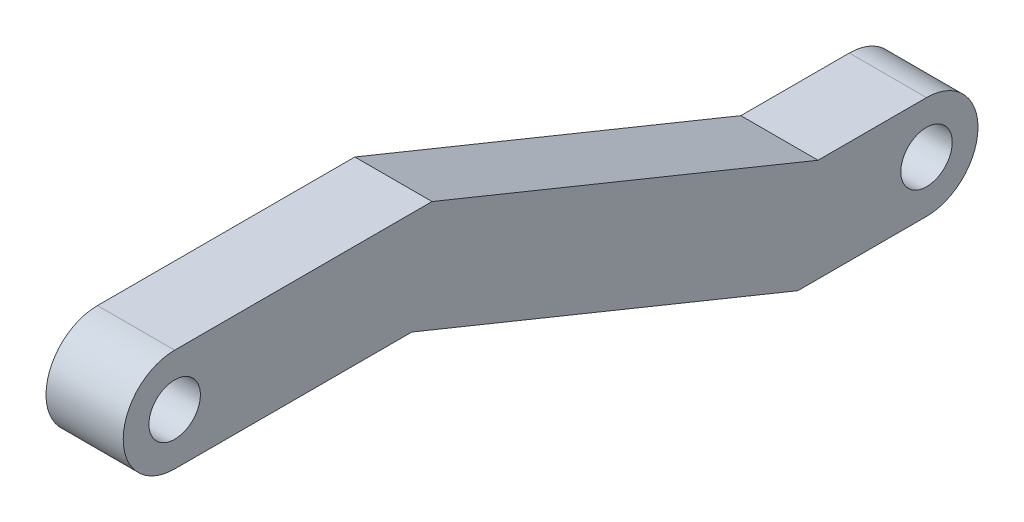
ISO-10303-21;
HEADER;
FILE_DESCRIPTION(('STEP AP214'),'2;1');
FILE_NAME('part.step','',(''),(''),'','','');
FILE_SCHEMA(('AUTOMOTIVE_DESIGN { 1 0 10303 214 1 1 1 1 }'));
ENDSEC;
DATA;
#1=APPLICATION_CONTEXT('core data for automotive mechanical design processes');
#2=APPLICATION_PROTOCOL_DEFINITION('international standard','automotive_design',2000,#1);
#3=PRODUCT_CONTEXT('',#1,'mechanical');
#4=PRODUCT('Part','Part','',(#3));
#5=PRODUCT_RELATED_PRODUCT_CATEGORY('part','',(#4));
#6=PRODUCT_DEFINITION_FORMATION('','',#4);
#7=PRODUCT_DEFINITION_CONTEXT('part definition',#1,'design');
#8=PRODUCT_DEFINITION('design','',#6,#7);
#9=PRODUCT_DEFINITION_SHAPE('','',#8);
#10=(LENGTH_UNIT() NAMED_UNIT(*) SI_UNIT(.MILLI.,.METRE.));
#11=(NAMED_UNIT(*) PLANE_ANGLE_UNIT() SI_UNIT($,.RADIAN.));
#12=(NAMED_UNIT(*) SI_UNIT($,.STERADIAN.) SOLID_ANGLE_UNIT());
#13=UNCERTAINTY_MEASURE_WITH_UNIT(LENGTH_MEASURE(1.E-05),#10,'distance_accuracy_value','');
#14=(GEOMETRIC_REPRESENTATION_CONTEXT(3) GLOBAL_UNCERTAINTY_ASSIGNED_CONTEXT((#13)) GLOBAL_UNIT_ASSIGNED_CONTEXT((#10,
#11,#12)) REPRESENTATION_CONTEXT('',''));
#15=CARTESIAN_POINT('',(0.,0.,0.));
#16=DIRECTION('',(0.,0.,1.));
#17=DIRECTION('',(1.,0.,0.));
#18=AXIS2_PLACEMENT_3D('',#15,#16,#17);
#19=CARTESIAN_POINT('',(3.,-2.,10.0014603676843));
#20=DIRECTION('',(1.,0.,0.));
#21=DIRECTION('',(0.,0.,-1.));
#22=AXIS2_PLACEMENT_3D('',#19,#20,#21);
#23=PLANE('',#22);
#24=CARTESIAN_POINT('',(3.,-2.,10.0014603676843));
#25=DIRECTION('',(1.,0.,0.));
#26=DIRECTION('',(0.,0.,-1.));
#27=AXIS2_PLACEMENT_3D('',#24,#25,#26);
#28=CIRCLE('',#27,1.);
#29=CARTESIAN_POINT('',(3.,-2.,9.00146036768433));
#30=VERTEX_POINT('',#29);
#31=EDGE_CURVE('E152',#30,#30,#28,.T.);
#32=ORIENTED_EDGE('',*,*,#31,.F.);
#33=EDGE_LOOP('',(#32));
#34=FACE_BOUND('',#33,.T.);
#35=DIRECTION('',(0.,0.377201339937969,0.926131280731302));
#36=VECTOR('',#35,1.);
#37=CARTESIAN_POINT('',(3.,-6.10930676545315,-15.));
#38=LINE('',#37,#36);
#39=CARTESIAN_POINT('',(3.,-6.10930676545315,-15.));
#40=VERTEX_POINT('',#39);
#41=CARTESIAN_POINT('',(3.,0.,0.));
#42=VERTEX_POINT('',#41);
#43=EDGE_CURVE('E170',#40,#42,#38,.T.);
#44=ORIENTED_EDGE('',*,*,#43,.T.);
#45=DIRECTION('',(0.,0.,1.));
#46=VECTOR('',#45,1.);
#47=CARTESIAN_POINT('',(3.,0.,0.));
#48=LINE('',#47,#46);
#49=CARTESIAN_POINT('',(3.,0.,10.0014603676843));
#50=VERTEX_POINT('',#49);
#51=EDGE_CURVE('E106',#42,#50,#48,.T.);
#52=ORIENTED_EDGE('',*,*,#51,.T.);
#53=CARTESIAN_POINT('',(3.,-2.,10.0014603676843));
#54=DIRECTION('',(1.,0.,0.));
#55=DIRECTION('',(0.,0.,-1.));
#56=AXIS2_PLACEMENT_3D('',#53,#54,#55);
#57=CIRCLE('',#56,2.);
#58=CARTESIAN_POINT('',(3.,-4.,10.0014603676843));
#59=VERTEX_POINT('',#58);
#60=EDGE_CURVE('E191',#50,#59,#57,.T.);
#61=ORIENTED_EDGE('',*,*,#60,.T.);
#62=DIRECTION('',(0.,0.,-1.));
#63=VECTOR('',#62,1.);
#64=CARTESIAN_POINT('',(3.,-4.,0.783334643305837));
#65=LINE('',#64,#63);
#66=CARTESIAN_POINT('',(3.,-4.,0.783334643305837));
#67=VERTEX_POINT('',#66);
#68=EDGE_CURVE('E205',#59,#67,#65,.T.);
#69=ORIENTED_EDGE('',*,*,#68,.T.);
#70=DIRECTION('',(0.,-0.377201339937969,-0.926131280731302));
#71=VECTOR('',#70,1.);
#72=CARTESIAN_POINT('',(3.,-10.1093067654531,-14.2166653566942));
#73=LINE('',#72,#71);
#74=CARTESIAN_POINT('',(3.,-10.1093067654531,-14.2166653566942));
#75=VERTEX_POINT('',#74);
#76=EDGE_CURVE('E125',#67,#75,#73,.T.);
#77=ORIENTED_EDGE('',*,*,#76,.T.);
#78=DIRECTION('',(0.,0.,-1.));
#79=VECTOR('',#78,1.);
#80=CARTESIAN_POINT('',(3.,-10.1093067654531,-14.2166653566942));
#81=LINE('',#80,#79);
#82=CARTESIAN_POINT('',(3.,-10.1093067654531,-19.2166653566942));
#83=VERTEX_POINT('',#82);
#84=EDGE_CURVE('E119',#75,#83,#81,.T.);
#85=ORIENTED_EDGE('',*,*,#84,.T.);
#86=CARTESIAN_POINT('',(3.,-8.10930676545315,-19.2166653566942));
#87=DIRECTION('',(1.,0.,0.));
#88=DIRECTION('',(0.,0.,1.));
#89=AXIS2_PLACEMENT_3D('',#86,#87,#88);
#90=CIRCLE('',#89,2.);
#91=CARTESIAN_POINT('',(3.,-6.10930676545315,-19.2166653566942));
#92=VERTEX_POINT('',#91);
#93=EDGE_CURVE('E123',#83,#92,#90,.T.);
#94=ORIENTED_EDGE('',*,*,#93,.T.);
#95=DIRECTION('',(0.,0.,1.));
#96=VECTOR('',#95,1.);
#97=CARTESIAN_POINT('',(3.,-6.10930676545315,-15.));
#98=LINE('',#97,#96);
#99=EDGE_CURVE('E63',#92,#40,#98,.T.);
#100=ORIENTED_EDGE('',*,*,#99,.T.);
#101=EDGE_LOOP('',(#44,#52,#61,#69,#77,#85,#94,#100));
#102=FACE_BOUND('',#101,.T.);
#103=CARTESIAN_POINT('',(3.,-8.10930676545315,-19.2166653566942));
#104=DIRECTION('',(1.,0.,0.));
#105=DIRECTION('',(0.,0.,-1.));
#106=AXIS2_PLACEMENT_3D('',#103,#104,#105);
#107=CIRCLE('',#106,1.00000000000001);
#108=CARTESIAN_POINT('',(3.,-8.10930676545315,-20.2166653566942));
#109=VERTEX_POINT('',#108);
#110=EDGE_CURVE('E219',#109,#109,#107,.T.);
#111=ORIENTED_EDGE('',*,*,#110,.F.);
#112=EDGE_LOOP('',(#111));
#113=FACE_BOUND('',#112,.T.);
#114=ADVANCED_FACE('F45',(#34,#102,#113),#23,.T.);
#115=CARTESIAN_POINT('',(0.,-2.,10.0014603676843));
#116=DIRECTION('',(1.,0.,0.));
#117=DIRECTION('',(0.,0.,-1.));
#118=AXIS2_PLACEMENT_3D('',#115,#116,#117);
#119=PLANE('',#118);
#120=DIRECTION('',(0.,0.377201339937969,0.926131280731302));
#121=VECTOR('',#120,1.);
#122=CARTESIAN_POINT('',(0.,-6.10930676545315,-15.));
#123=LINE('',#122,#121);
#124=CARTESIAN_POINT('',(0.,-6.10930676545315,-15.));
#125=VERTEX_POINT('',#124);
#126=CARTESIAN_POINT('',(0.,0.,0.));
#127=VERTEX_POINT('',#126);
#128=EDGE_CURVE('E147',#125,#127,#123,.T.);
#129=ORIENTED_EDGE('',*,*,#128,.F.);
#130=DIRECTION('',(0.,0.,1.));
#131=VECTOR('',#130,1.);
#132=CARTESIAN_POINT('',(0.,-6.10930676545315,-15.));
#133=LINE('',#132,#131);
#134=CARTESIAN_POINT('',(0.,-6.10930676545315,-19.2166653566942));
#135=VERTEX_POINT('',#134);
#136=EDGE_CURVE('E98',#135,#125,#133,.T.);
#137=ORIENTED_EDGE('',*,*,#136,.F.);
#138=CARTESIAN_POINT('',(0.,-8.10930676545315,-19.2166653566942));
#139=DIRECTION('',(1.,0.,0.));
#140=DIRECTION('',(0.,0.,1.));
#141=AXIS2_PLACEMENT_3D('',#138,#139,#140);
#142=CIRCLE('',#141,2.);
#143=CARTESIAN_POINT('',(0.,-10.1093067654531,-19.2166653566942));
#144=VERTEX_POINT('',#143);
#145=EDGE_CURVE('E92',#144,#135,#142,.T.);
#146=ORIENTED_EDGE('',*,*,#145,.F.);
#147=DIRECTION('',(0.,0.,-1.));
#148=VECTOR('',#147,1.);
#149=CARTESIAN_POINT('',(0.,-10.1093067654531,-14.2166653566942));
#150=LINE('',#149,#148);
#151=CARTESIAN_POINT('',(0.,-10.1093067654531,-14.2166653566942));
#152=VERTEX_POINT('',#151);
#153=EDGE_CURVE('E134',#152,#144,#150,.T.);
#154=ORIENTED_EDGE('',*,*,#153,.F.);
#155=DIRECTION('',(0.,-0.377201339937969,-0.926131280731302));
#156=VECTOR('',#155,1.);
#157=CARTESIAN_POINT('',(0.,-10.1093067654531,-14.2166653566942));
#158=LINE('',#157,#156);
#159=CARTESIAN_POINT('',(0.,-4.,0.783334643305837));
#160=VERTEX_POINT('',#159);
#161=EDGE_CURVE('E161',#160,#152,#158,.T.);
#162=ORIENTED_EDGE('',*,*,#161,.F.);
#163=DIRECTION('',(0.,0.,-1.));
#164=VECTOR('',#163,1.);
#165=CARTESIAN_POINT('',(0.,-4.,0.783334643305837));
#166=LINE('',#165,#164);
#167=CARTESIAN_POINT('',(0.,-4.,10.0014603676843));
#168=VERTEX_POINT('',#167);
#169=EDGE_CURVE('E158',#168,#160,#166,.T.);
#170=ORIENTED_EDGE('',*,*,#169,.F.);
#171=CARTESIAN_POINT('',(0.,-2.,10.0014603676843));
#172=DIRECTION('',(1.,0.,0.));
#173=DIRECTION('',(0.,0.,-1.));
#174=AXIS2_PLACEMENT_3D('',#171,#172,#173);
#175=CIRCLE('',#174,2.);
#176=CARTESIAN_POINT('',(0.,0.,10.0014603676843));
#177=VERTEX_POINT('',#176);
#178=EDGE_CURVE('E155',#177,#168,#175,.T.);
#179=ORIENTED_EDGE('',*,*,#178,.F.);
#180=DIRECTION('',(0.,0.,1.));
#181=VECTOR('',#180,1.);
#182=CARTESIAN_POINT('',(0.,0.,0.));
#183=LINE('',#182,#181);
#184=EDGE_CURVE('E151',#127,#177,#183,.T.);
#185=ORIENTED_EDGE('',*,*,#184,.F.);
#186=EDGE_LOOP('',(#129,#137,#146,#154,#162,#170,#179,#185));
#187=FACE_BOUND('',#186,.T.);
#188=CARTESIAN_POINT('',(0.,-2.,10.0014603676843));
#189=DIRECTION('',(1.,0.,0.));
#190=DIRECTION('',(0.,0.,-1.));
#191=AXIS2_PLACEMENT_3D('',#188,#189,#190);
#192=CIRCLE('',#191,1.);
#193=CARTESIAN_POINT('',(0.,-2.,9.00146036768433));
#194=VERTEX_POINT('',#193);
#195=EDGE_CURVE('E215',#194,#194,#192,.T.);
#196=ORIENTED_EDGE('',*,*,#195,.T.);
#197=EDGE_LOOP('',(#196));
#198=FACE_BOUND('',#197,.T.);
#199=CARTESIAN_POINT('',(0.,-8.10930676545315,-19.2166653566942));
#200=DIRECTION('',(1.,0.,0.));
#201=DIRECTION('',(0.,0.,-1.));
#202=AXIS2_PLACEMENT_3D('',#199,#200,#201);
#203=CIRCLE('',#202,1.00000000000001);
#204=CARTESIAN_POINT('',(0.,-8.10930676545315,-20.2166653566942));
#205=VERTEX_POINT('',#204);
#206=EDGE_CURVE('E223',#205,#205,#203,.T.);
#207=ORIENTED_EDGE('',*,*,#206,.T.);
#208=EDGE_LOOP('',(#207));
#209=FACE_BOUND('',#208,.T.);
#210=ADVANCED_FACE('F195',(#187,#198,#209),#119,.F.);
#211=CARTESIAN_POINT('',(3.,-6.10930676545315,-15.));
#212=DIRECTION('',(0.,-0.926131280731301,0.377201339937969));
#213=DIRECTION('',(0.,-0.377201339937969,-0.926131280731302));
#214=AXIS2_PLACEMENT_3D('',#211,#212,#213);
#215=PLANE('',#214);
#216=ORIENTED_EDGE('',*,*,#128,.T.);
#217=DIRECTION('',(-1.,0.,0.));
#218=VECTOR('',#217,1.);
#219=CARTESIAN_POINT('',(3.,0.,0.));
#220=LINE('',#219,#218);
#221=EDGE_CURVE('E11',#42,#127,#220,.T.);
#222=ORIENTED_EDGE('',*,*,#221,.F.);
#223=ORIENTED_EDGE('',*,*,#43,.F.);
#224=DIRECTION('',(-1.,0.,0.));
#225=VECTOR('',#224,1.);
#226=CARTESIAN_POINT('',(3.,-6.10930676545315,-15.));
#227=LINE('',#226,#225);
#228=EDGE_CURVE('E143',#40,#125,#227,.T.);
#229=ORIENTED_EDGE('',*,*,#228,.T.);
#230=EDGE_LOOP('',(#216,#222,#223,#229));
#231=FACE_BOUND('',#230,.T.);
#232=ADVANCED_FACE('F47',(#231),#215,.F.);
#233=CARTESIAN_POINT('',(3.,0.,0.));
#234=DIRECTION('',(0.,-1.,0.));
#235=DIRECTION('',(0.,0.,-1.));
#236=AXIS2_PLACEMENT_3D('',#233,#234,#235);
#237=PLANE('',#236);
#238=ORIENTED_EDGE('',*,*,#184,.T.);
#239=DIRECTION('',(-1.,0.,0.));
#240=VECTOR('',#239,1.);
#241=CARTESIAN_POINT('',(3.,0.,10.0014603676843));
#242=LINE('',#241,#240);
#243=EDGE_CURVE('E55',#50,#177,#242,.T.);
#244=ORIENTED_EDGE('',*,*,#243,.F.);
#245=ORIENTED_EDGE('',*,*,#51,.F.);
#246=ORIENTED_EDGE('',*,*,#221,.T.);
#247=EDGE_LOOP('',(#238,#244,#245,#246));
#248=FACE_BOUND('',#247,.T.);
#249=ADVANCED_FACE('F257',(#248),#237,.F.);
#250=CARTESIAN_POINT('',(3.,-2.,10.0014603676843));
#251=DIRECTION('',(-1.,0.,0.));
#252=DIRECTION('',(0.,0.,1.));
#253=AXIS2_PLACEMENT_3D('',#250,#251,#252);
#254=CYLINDRICAL_SURFACE('',#253,2.);
#255=ORIENTED_EDGE('',*,*,#178,.T.);
#256=DIRECTION('',(-1.,0.,0.));
#257=VECTOR('',#256,1.);
#258=CARTESIAN_POINT('',(3.,-4.,10.0014603676843));
#259=LINE('',#258,#257);
#260=EDGE_CURVE('E181',#59,#168,#259,.T.);
#261=ORIENTED_EDGE('',*,*,#260,.F.);
#262=ORIENTED_EDGE('',*,*,#60,.F.);
#263=ORIENTED_EDGE('',*,*,#243,.T.);
#264=EDGE_LOOP('',(#255,#261,#262,#263));
#265=FACE_BOUND('',#264,.T.);
#266=ADVANCED_FACE('F189',(#265),#254,.T.);
#267=CARTESIAN_POINT('',(3.,-4.,0.783334643305837));
#268=DIRECTION('',(0.,1.,0.));
#269=DIRECTION('',(0.,0.,1.));
#270=AXIS2_PLACEMENT_3D('',#267,#268,#269);
#271=PLANE('',#270);
#272=ORIENTED_EDGE('',*,*,#169,.T.);
#273=DIRECTION('',(-1.,0.,0.));
#274=VECTOR('',#273,1.);
#275=CARTESIAN_POINT('',(3.,-4.,0.783334643305837));
#276=LINE('',#275,#274);
#277=EDGE_CURVE('E177',#67,#160,#276,.T.);
#278=ORIENTED_EDGE('',*,*,#277,.F.);
#279=ORIENTED_EDGE('',*,*,#68,.F.);
#280=ORIENTED_EDGE('',*,*,#260,.T.);
#281=EDGE_LOOP('',(#272,#278,#279,#280));
#282=FACE_BOUND('',#281,.T.);
#283=ADVANCED_FACE('F200',(#282),#271,.F.);
#284=CARTESIAN_POINT('',(3.,-10.1093067654531,-14.2166653566942));
#285=DIRECTION('',(0.,0.926131280731301,-0.377201339937969));
#286=DIRECTION('',(0.,0.377201339937969,0.926131280731302));
#287=AXIS2_PLACEMENT_3D('',#284,#285,#286);
#288=PLANE('',#287);
#289=ORIENTED_EDGE('',*,*,#161,.T.);
#290=DIRECTION('',(-1.,0.,0.));
#291=VECTOR('',#290,1.);
#292=CARTESIAN_POINT('',(3.,-10.1093067654531,-14.2166653566942));
#293=LINE('',#292,#291);
#294=EDGE_CURVE('E136',#75,#152,#293,.T.);
#295=ORIENTED_EDGE('',*,*,#294,.F.);
#296=ORIENTED_EDGE('',*,*,#76,.F.);
#297=ORIENTED_EDGE('',*,*,#277,.T.);
#298=EDGE_LOOP('',(#289,#295,#296,#297));
#299=FACE_BOUND('',#298,.T.);
#300=ADVANCED_FACE('F203',(#299),#288,.F.);
#301=CARTESIAN_POINT('',(3.,-10.1093067654531,-14.2166653566942));
#302=DIRECTION('',(0.,1.,0.));
#303=DIRECTION('',(0.,0.,1.));
#304=AXIS2_PLACEMENT_3D('',#301,#302,#303);
#305=PLANE('',#304);
#306=ORIENTED_EDGE('',*,*,#153,.T.);
#307=DIRECTION('',(-1.,0.,0.));
#308=VECTOR('',#307,1.);
#309=CARTESIAN_POINT('',(3.,-10.1093067654531,-19.2166653566942));
#310=LINE('',#309,#308);
#311=EDGE_CURVE('E131',#83,#144,#310,.T.);
#312=ORIENTED_EDGE('',*,*,#311,.F.);
#313=ORIENTED_EDGE('',*,*,#84,.F.);
#314=ORIENTED_EDGE('',*,*,#294,.T.);
#315=EDGE_LOOP('',(#306,#312,#313,#314));
#316=FACE_BOUND('',#315,.T.);
#317=ADVANCED_FACE('F132',(#316),#305,.F.);
#318=CARTESIAN_POINT('',(3.,-8.10930676545315,-19.2166653566942));
#319=DIRECTION('',(-1.,0.,0.));
#320=DIRECTION('',(0.,0.,1.));
#321=AXIS2_PLACEMENT_3D('',#318,#319,#320);
#322=CYLINDRICAL_SURFACE('',#321,2.);
#323=ORIENTED_EDGE('',*,*,#145,.T.);
#324=DIRECTION('',(-1.,0.,0.));
#325=VECTOR('',#324,1.);
#326=CARTESIAN_POINT('',(3.,-6.10930676545315,-19.2166653566942));
#327=LINE('',#326,#325);
#328=EDGE_CURVE('E137',#92,#135,#327,.T.);
#329=ORIENTED_EDGE('',*,*,#328,.F.);
#330=ORIENTED_EDGE('',*,*,#93,.F.);
#331=ORIENTED_EDGE('',*,*,#311,.T.);
#332=EDGE_LOOP('',(#323,#329,#330,#331));
#333=FACE_BOUND('',#332,.T.);
#334=ADVANCED_FACE('F139',(#333),#322,.T.);
#335=CARTESIAN_POINT('',(3.,-6.10930676545315,-15.));
#336=DIRECTION('',(0.,-1.,0.));
#337=DIRECTION('',(0.,0.,-1.));
#338=AXIS2_PLACEMENT_3D('',#335,#336,#337);
#339=PLANE('',#338);
#340=ORIENTED_EDGE('',*,*,#136,.T.);
#341=ORIENTED_EDGE('',*,*,#228,.F.);
#342=ORIENTED_EDGE('',*,*,#99,.F.);
#343=ORIENTED_EDGE('',*,*,#328,.T.);
#344=EDGE_LOOP('',(#340,#341,#342,#343));
#345=FACE_BOUND('',#344,.T.);
#346=ADVANCED_FACE('F245',(#345),#339,.F.);
#347=CARTESIAN_POINT('',(3.,-2.,10.0014603676843));
#348=DIRECTION('',(-1.,0.,0.));
#349=DIRECTION('',(0.,0.,1.));
#350=AXIS2_PLACEMENT_3D('',#347,#348,#349);
#351=CYLINDRICAL_SURFACE('',#350,1.);
#352=ORIENTED_EDGE('',*,*,#31,.T.);
#353=EDGE_LOOP('',(#352));
#354=FACE_BOUND('',#353,.T.);
#355=ORIENTED_EDGE('',*,*,#195,.F.);
#356=EDGE_LOOP('',(#355));
#357=FACE_BOUND('',#356,.T.);
#358=ADVANCED_FACE('F242',(#354,#357),#351,.F.);
#359=CARTESIAN_POINT('',(3.,-8.10930676545315,-19.2166653566942));
#360=DIRECTION('',(-1.,0.,0.));
#361=DIRECTION('',(0.,0.,1.));
#362=AXIS2_PLACEMENT_3D('',#359,#360,#361);
#363=CYLINDRICAL_SURFACE('',#362,1.00000000000001);
#364=ORIENTED_EDGE('',*,*,#110,.T.);
#365=EDGE_LOOP('',(#364));
#366=FACE_BOUND('',#365,.T.);
#367=ORIENTED_EDGE('',*,*,#206,.F.);
#368=EDGE_LOOP('',(#367));
#369=FACE_BOUND('',#368,.T.);
#370=ADVANCED_FACE('F231',(#366,#369),#363,.F.);
#371=CLOSED_SHELL('',(#114,#210,#232,#249,#266,#283,#300,#317,#334,#346,#358,#370));
#372=MANIFOLD_SOLID_BREP('B2',#371);
#373=ADVANCED_BREP_SHAPE_REPRESENTATION('',(#18,#372),#14);
#374=SHAPE_DEFINITION_REPRESENTATION(#9,#373);
ENDSEC;
END-ISO-10303-21;
